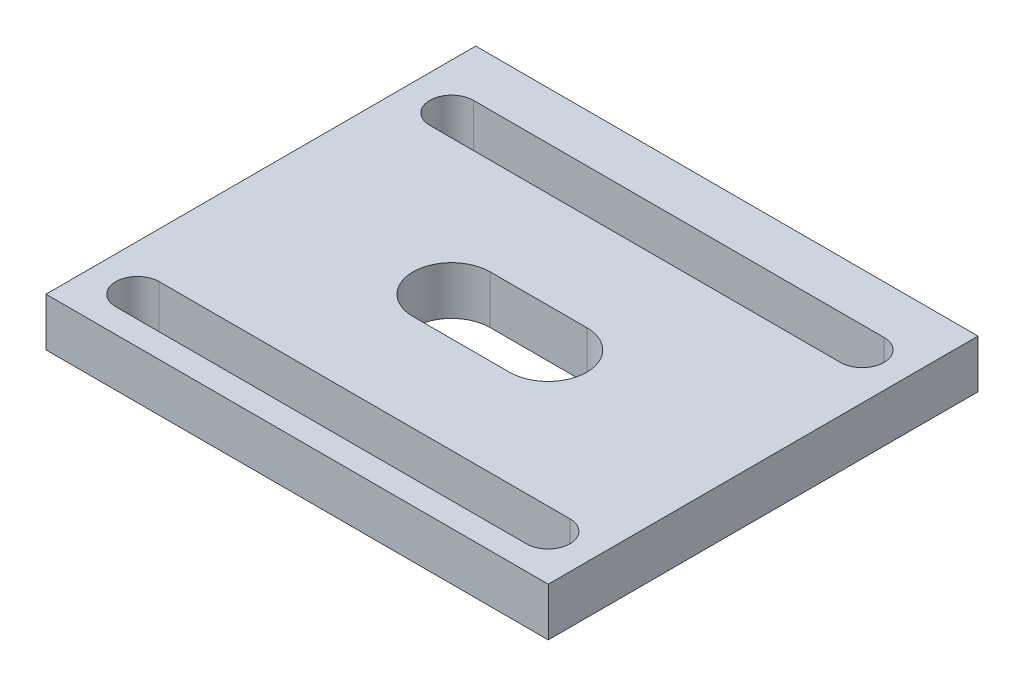
ISO-10303-21;
HEADER;
FILE_DESCRIPTION(('STEP AP214'),'2;1');
FILE_NAME('part.step','',(''),(''),'','','');
FILE_SCHEMA(('AUTOMOTIVE_DESIGN { 1 0 10303 214 1 1 1 1 }'));
ENDSEC;
DATA;
#1=APPLICATION_CONTEXT('core data for automotive mechanical design processes');
#2=APPLICATION_PROTOCOL_DEFINITION('international standard','automotive_design',2000,#1);
#3=PRODUCT_CONTEXT('',#1,'mechanical');
#4=PRODUCT('Part','Part','',(#3));
#5=PRODUCT_RELATED_PRODUCT_CATEGORY('part','',(#4));
#6=PRODUCT_DEFINITION_FORMATION('','',#4);
#7=PRODUCT_DEFINITION_CONTEXT('part definition',#1,'design');
#8=PRODUCT_DEFINITION('design','',#6,#7);
#9=PRODUCT_DEFINITION_SHAPE('','',#8);
#10=(LENGTH_UNIT() NAMED_UNIT(*) SI_UNIT(.MILLI.,.METRE.));
#11=(NAMED_UNIT(*) PLANE_ANGLE_UNIT() SI_UNIT($,.RADIAN.));
#12=(NAMED_UNIT(*) SI_UNIT($,.STERADIAN.) SOLID_ANGLE_UNIT());
#13=UNCERTAINTY_MEASURE_WITH_UNIT(LENGTH_MEASURE(1.E-05),#10,'distance_accuracy_value','');
#14=(GEOMETRIC_REPRESENTATION_CONTEXT(3) GLOBAL_UNCERTAINTY_ASSIGNED_CONTEXT((#13)) GLOBAL_UNIT_ASSIGNED_CONTEXT((#10,
#11,#12)) REPRESENTATION_CONTEXT('',''));
#15=CARTESIAN_POINT('',(0.,0.,0.));
#16=DIRECTION('',(0.,0.,1.));
#17=DIRECTION('',(1.,0.,0.));
#18=AXIS2_PLACEMENT_3D('',#15,#16,#17);
#19=CARTESIAN_POINT('',(90.6267671094663,5.,-29.3531684248269));
#20=DIRECTION('',(0.,1.,0.));
#21=DIRECTION('',(0.,0.,1.));
#22=AXIS2_PLACEMENT_3D('',#19,#20,#21);
#23=PLANE('',#22);
#24=DIRECTION('',(1.,0.,0.));
#25=VECTOR('',#24,1.);
#26=CARTESIAN_POINT('',(48.6267671094663,5.,6.14683157517306));
#27=LINE('',#26,#25);
#28=CARTESIAN_POINT('',(48.6267671094663,5.,6.14683157517306));
#29=VERTEX_POINT('',#28);
#30=CARTESIAN_POINT('',(58.6267671094663,5.,6.14683157517306));
#31=VERTEX_POINT('',#30);
#32=EDGE_CURVE('E179',#29,#31,#27,.T.);
#33=ORIENTED_EDGE('',*,*,#32,.F.);
#34=CARTESIAN_POINT('',(48.6267671094662,5.,2.14683157517306));
#35=DIRECTION('',(0.,1.,0.));
#36=DIRECTION('',(0.,0.,1.));
#37=AXIS2_PLACEMENT_3D('',#34,#35,#36);
#38=CIRCLE('',#37,4.);
#39=CARTESIAN_POINT('',(48.6267671094663,5.,-1.85316842482694));
#40=VERTEX_POINT('',#39);
#41=EDGE_CURVE('E177',#40,#29,#38,.T.);
#42=ORIENTED_EDGE('',*,*,#41,.F.);
#43=DIRECTION('',(-1.,0.,0.));
#44=VECTOR('',#43,1.);
#45=CARTESIAN_POINT('',(48.6267671094663,5.,-1.85316842482694));
#46=LINE('',#45,#44);
#47=CARTESIAN_POINT('',(58.6267671094663,5.,-1.85316842482694));
#48=VERTEX_POINT('',#47);
#49=EDGE_CURVE('E184',#48,#40,#46,.T.);
#50=ORIENTED_EDGE('',*,*,#49,.F.);
#51=CARTESIAN_POINT('',(58.6267671094663,5.,2.14683157517306));
#52=DIRECTION('',(0.,1.,0.));
#53=DIRECTION('',(0.,0.,1.));
#54=AXIS2_PLACEMENT_3D('',#51,#52,#53);
#55=CIRCLE('',#54,4.);
#56=EDGE_CURVE('E182',#31,#48,#55,.T.);
#57=ORIENTED_EDGE('',*,*,#56,.F.);
#58=EDGE_LOOP('',(#33,#42,#50,#57));
#59=FACE_BOUND('',#58,.T.);
#60=DIRECTION('',(1.,0.,0.));
#61=VECTOR('',#60,1.);
#62=CARTESIAN_POINT('',(32.3633111421756,5.,20.6602875424637));
#63=LINE('',#62,#61);
#64=CARTESIAN_POINT('',(32.3633111421756,5.,20.6602875424637));
#65=VERTEX_POINT('',#64);
#66=CARTESIAN_POINT('',(74.8902230767569,5.,20.6602875424637));
#67=VERTEX_POINT('',#66);
#68=EDGE_CURVE('E208',#65,#67,#63,.T.);
#69=ORIENTED_EDGE('',*,*,#68,.F.);
#70=CARTESIAN_POINT('',(32.3633111421756,5.,18.4102875424637));
#71=DIRECTION('',(0.,1.,0.));
#72=DIRECTION('',(0.,0.,-1.));
#73=AXIS2_PLACEMENT_3D('',#70,#71,#72);
#74=CIRCLE('',#73,2.25);
#75=CARTESIAN_POINT('',(32.3633111421756,5.,16.1602875424637));
#76=VERTEX_POINT('',#75);
#77=EDGE_CURVE('E206',#76,#65,#74,.T.);
#78=ORIENTED_EDGE('',*,*,#77,.F.);
#79=DIRECTION('',(-1.,0.,0.));
#80=VECTOR('',#79,1.);
#81=CARTESIAN_POINT('',(32.3633111421756,5.,16.1602875424637));
#82=LINE('',#81,#80);
#83=CARTESIAN_POINT('',(74.8902230767569,5.,16.1602875424637));
#84=VERTEX_POINT('',#83);
#85=EDGE_CURVE('E214',#84,#76,#82,.T.);
#86=ORIENTED_EDGE('',*,*,#85,.F.);
#87=CARTESIAN_POINT('',(74.8902230767569,5.,18.4102875424637));
#88=DIRECTION('',(0.,1.,0.));
#89=DIRECTION('',(0.,0.,-1.));
#90=AXIS2_PLACEMENT_3D('',#87,#88,#89);
#91=CIRCLE('',#90,2.25);
#92=EDGE_CURVE('E211',#67,#84,#91,.T.);
#93=ORIENTED_EDGE('',*,*,#92,.F.);
#94=EDGE_LOOP('',(#69,#78,#86,#93));
#95=FACE_BOUND('',#94,.T.);
#96=DIRECTION('',(1.,0.,0.));
#97=VECTOR('',#96,1.);
#98=CARTESIAN_POINT('',(32.3633111421756,5.,-11.8666243921175));
#99=LINE('',#98,#97);
#100=CARTESIAN_POINT('',(32.3633111421756,5.,-11.8666243921175));
#101=VERTEX_POINT('',#100);
#102=CARTESIAN_POINT('',(74.8902230767569,5.,-11.8666243921175));
#103=VERTEX_POINT('',#102);
#104=EDGE_CURVE('E239',#101,#103,#99,.T.);
#105=ORIENTED_EDGE('',*,*,#104,.F.);
#106=CARTESIAN_POINT('',(32.3633111421756,5.,-14.1166243921175));
#107=DIRECTION('',(0.,1.,0.));
#108=DIRECTION('',(0.,0.,1.));
#109=AXIS2_PLACEMENT_3D('',#106,#107,#108);
#110=CIRCLE('',#109,2.25);
#111=CARTESIAN_POINT('',(32.3633111421756,5.,-16.3666243921175));
#112=VERTEX_POINT('',#111);
#113=EDGE_CURVE('E237',#112,#101,#110,.T.);
#114=ORIENTED_EDGE('',*,*,#113,.F.);
#115=DIRECTION('',(-1.,0.,0.));
#116=VECTOR('',#115,1.);
#117=CARTESIAN_POINT('',(32.3633111421756,5.,-16.3666243921175));
#118=LINE('',#117,#116);
#119=CARTESIAN_POINT('',(74.8902230767569,5.,-16.3666243921175));
#120=VERTEX_POINT('',#119);
#121=EDGE_CURVE('E245',#120,#112,#118,.T.);
#122=ORIENTED_EDGE('',*,*,#121,.F.);
#123=CARTESIAN_POINT('',(74.8902230767569,5.,-14.1166243921175));
#124=DIRECTION('',(0.,1.,0.));
#125=DIRECTION('',(0.,0.,1.));
#126=AXIS2_PLACEMENT_3D('',#123,#124,#125);
#127=CIRCLE('',#126,2.25);
#128=EDGE_CURVE('E242',#103,#120,#127,.T.);
#129=ORIENTED_EDGE('',*,*,#128,.F.);
#130=EDGE_LOOP('',(#105,#114,#122,#129));
#131=FACE_BOUND('',#130,.T.);
#132=DIRECTION('',(0.,0.,-1.));
#133=VECTOR('',#132,1.);
#134=CARTESIAN_POINT('',(27.6267671094663,5.,-31.3531684248269));
#135=LINE('',#134,#133);
#136=CARTESIAN_POINT('',(27.6267671094663,5.,23.1468315751731));
#137=VERTEX_POINT('',#136);
#138=CARTESIAN_POINT('',(27.6267671094663,5.,-21.3531684248269));
#139=VERTEX_POINT('',#138);
#140=EDGE_CURVE('E161',#137,#139,#135,.T.);
#141=ORIENTED_EDGE('',*,*,#140,.F.);
#142=DIRECTION('',(1.,0.,0.));
#143=VECTOR('',#142,1.);
#144=CARTESIAN_POINT('',(0.,5.,23.1468315751731));
#145=LINE('',#144,#143);
#146=CARTESIAN_POINT('',(79.6402230767569,5.,23.1468315751731));
#147=VERTEX_POINT('',#146);
#148=EDGE_CURVE('E148',#137,#147,#145,.T.);
#149=ORIENTED_EDGE('',*,*,#148,.T.);
#150=DIRECTION('',(0.,0.,1.));
#151=VECTOR('',#150,1.);
#152=CARTESIAN_POINT('',(79.6402230767569,5.,0.));
#153=LINE('',#152,#151);
#154=CARTESIAN_POINT('',(79.6402230767569,5.,-21.3531684248269));
#155=VERTEX_POINT('',#154);
#156=EDGE_CURVE('E475',#155,#147,#153,.T.);
#157=ORIENTED_EDGE('',*,*,#156,.F.);
#158=DIRECTION('',(1.,0.,0.));
#159=VECTOR('',#158,1.);
#160=CARTESIAN_POINT('',(0.,5.,-21.3531684248269));
#161=LINE('',#160,#159);
#162=EDGE_CURVE('E167',#139,#155,#161,.T.);
#163=ORIENTED_EDGE('',*,*,#162,.F.);
#164=EDGE_LOOP('',(#141,#149,#157,#163));
#165=FACE_BOUND('',#164,.T.);
#166=ADVANCED_FACE('F38',(#59,#95,#131,#165),#23,.T.);
#167=CARTESIAN_POINT('',(90.6267671094663,0.,-29.3531684248269));
#168=DIRECTION('',(0.,1.,0.));
#169=DIRECTION('',(0.,0.,1.));
#170=AXIS2_PLACEMENT_3D('',#167,#168,#169);
#171=PLANE('',#170);
#172=CARTESIAN_POINT('',(32.3633111421756,0.,18.4102875424637));
#173=DIRECTION('',(0.,1.,0.));
#174=DIRECTION('',(0.,0.,-1.));
#175=AXIS2_PLACEMENT_3D('',#172,#173,#174);
#176=CIRCLE('',#175,2.25);
#177=CARTESIAN_POINT('',(32.3633111421756,0.,16.1602875424637));
#178=VERTEX_POINT('',#177);
#179=CARTESIAN_POINT('',(32.3633111421756,0.,20.6602875424637));
#180=VERTEX_POINT('',#179);
#181=EDGE_CURVE('E205',#178,#180,#176,.T.);
#182=ORIENTED_EDGE('',*,*,#181,.T.);
#183=DIRECTION('',(1.,0.,0.));
#184=VECTOR('',#183,1.);
#185=CARTESIAN_POINT('',(32.3633111421756,0.,20.6602875424637));
#186=LINE('',#185,#184);
#187=CARTESIAN_POINT('',(74.8902230767569,0.,20.6602875424637));
#188=VERTEX_POINT('',#187);
#189=EDGE_CURVE('E219',#180,#188,#186,.T.);
#190=ORIENTED_EDGE('',*,*,#189,.T.);
#191=CARTESIAN_POINT('',(74.8902230767569,0.,18.4102875424637));
#192=DIRECTION('',(0.,1.,0.));
#193=DIRECTION('',(0.,0.,-1.));
#194=AXIS2_PLACEMENT_3D('',#191,#192,#193);
#195=CIRCLE('',#194,2.25);
#196=CARTESIAN_POINT('',(74.8902230767569,0.,16.1602875424637));
#197=VERTEX_POINT('',#196);
#198=EDGE_CURVE('E222',#188,#197,#195,.T.);
#199=ORIENTED_EDGE('',*,*,#198,.T.);
#200=DIRECTION('',(-1.,0.,0.));
#201=VECTOR('',#200,1.);
#202=CARTESIAN_POINT('',(32.3633111421756,0.,16.1602875424637));
#203=LINE('',#202,#201);
#204=EDGE_CURVE('E209',#197,#178,#203,.T.);
#205=ORIENTED_EDGE('',*,*,#204,.T.);
#206=EDGE_LOOP('',(#182,#190,#199,#205));
#207=FACE_BOUND('',#206,.T.);
#208=CARTESIAN_POINT('',(32.3633111421756,0.,-14.1166243921175));
#209=DIRECTION('',(0.,1.,0.));
#210=DIRECTION('',(0.,0.,1.));
#211=AXIS2_PLACEMENT_3D('',#208,#209,#210);
#212=CIRCLE('',#211,2.25);
#213=CARTESIAN_POINT('',(32.3633111421756,0.,-16.3666243921175));
#214=VERTEX_POINT('',#213);
#215=CARTESIAN_POINT('',(32.3633111421756,0.,-11.8666243921175));
#216=VERTEX_POINT('',#215);
#217=EDGE_CURVE('E236',#214,#216,#212,.T.);
#218=ORIENTED_EDGE('',*,*,#217,.T.);
#219=DIRECTION('',(1.,0.,0.));
#220=VECTOR('',#219,1.);
#221=CARTESIAN_POINT('',(32.3633111421756,0.,-11.8666243921175));
#222=LINE('',#221,#220);
#223=CARTESIAN_POINT('',(74.8902230767569,0.,-11.8666243921175));
#224=VERTEX_POINT('',#223);
#225=EDGE_CURVE('E250',#216,#224,#222,.T.);
#226=ORIENTED_EDGE('',*,*,#225,.T.);
#227=CARTESIAN_POINT('',(74.8902230767569,0.,-14.1166243921175));
#228=DIRECTION('',(0.,1.,0.));
#229=DIRECTION('',(0.,0.,1.));
#230=AXIS2_PLACEMENT_3D('',#227,#228,#229);
#231=CIRCLE('',#230,2.25);
#232=CARTESIAN_POINT('',(74.8902230767569,0.,-16.3666243921175));
#233=VERTEX_POINT('',#232);
#234=EDGE_CURVE('E253',#224,#233,#231,.T.);
#235=ORIENTED_EDGE('',*,*,#234,.T.);
#236=DIRECTION('',(-1.,0.,0.));
#237=VECTOR('',#236,1.);
#238=CARTESIAN_POINT('',(32.3633111421756,0.,-16.3666243921175));
#239=LINE('',#238,#237);
#240=EDGE_CURVE('E240',#233,#214,#239,.T.);
#241=ORIENTED_EDGE('',*,*,#240,.T.);
#242=EDGE_LOOP('',(#218,#226,#235,#241));
#243=FACE_BOUND('',#242,.T.);
#244=CARTESIAN_POINT('',(48.6267671094662,0.,2.14683157517306));
#245=DIRECTION('',(0.,1.,0.));
#246=DIRECTION('',(0.,0.,1.));
#247=AXIS2_PLACEMENT_3D('',#244,#245,#246);
#248=CIRCLE('',#247,4.);
#249=CARTESIAN_POINT('',(48.6267671094663,0.,-1.85316842482694));
#250=VERTEX_POINT('',#249);
#251=CARTESIAN_POINT('',(48.6267671094663,0.,6.14683157517306));
#252=VERTEX_POINT('',#251);
#253=EDGE_CURVE('E170',#250,#252,#248,.T.);
#254=ORIENTED_EDGE('',*,*,#253,.T.);
#255=DIRECTION('',(1.,0.,0.));
#256=VECTOR('',#255,1.);
#257=CARTESIAN_POINT('',(48.6267671094663,0.,6.14683157517306));
#258=LINE('',#257,#256);
#259=CARTESIAN_POINT('',(58.6267671094663,0.,6.14683157517306));
#260=VERTEX_POINT('',#259);
#261=EDGE_CURVE('E189',#252,#260,#258,.T.);
#262=ORIENTED_EDGE('',*,*,#261,.T.);
#263=CARTESIAN_POINT('',(58.6267671094663,0.,2.14683157517306));
#264=DIRECTION('',(0.,1.,0.));
#265=DIRECTION('',(0.,0.,1.));
#266=AXIS2_PLACEMENT_3D('',#263,#264,#265);
#267=CIRCLE('',#266,4.);
#268=CARTESIAN_POINT('',(58.6267671094663,0.,-1.85316842482694));
#269=VERTEX_POINT('',#268);
#270=EDGE_CURVE('E192',#260,#269,#267,.T.);
#271=ORIENTED_EDGE('',*,*,#270,.T.);
#272=DIRECTION('',(-1.,0.,0.));
#273=VECTOR('',#272,1.);
#274=CARTESIAN_POINT('',(48.6267671094663,0.,-1.85316842482694));
#275=LINE('',#274,#273);
#276=EDGE_CURVE('E180',#269,#250,#275,.T.);
#277=ORIENTED_EDGE('',*,*,#276,.T.);
#278=EDGE_LOOP('',(#254,#262,#271,#277));
#279=FACE_BOUND('',#278,.T.);
#280=DIRECTION('',(1.,0.,0.));
#281=VECTOR('',#280,1.);
#282=CARTESIAN_POINT('',(90.6267671094663,0.,23.1468315751731));
#283=LINE('',#282,#281);
#284=CARTESIAN_POINT('',(27.6267671094663,0.,23.1468315751731));
#285=VERTEX_POINT('',#284);
#286=CARTESIAN_POINT('',(79.6402230767569,0.,23.1468315751731));
#287=VERTEX_POINT('',#286);
#288=EDGE_CURVE('E52',#285,#287,#283,.T.);
#289=ORIENTED_EDGE('',*,*,#288,.F.);
#290=DIRECTION('',(0.,0.,-1.));
#291=VECTOR('',#290,1.);
#292=CARTESIAN_POINT('',(27.6267671094663,0.,-29.3531684248269));
#293=LINE('',#292,#291);
#294=CARTESIAN_POINT('',(27.6267671094663,0.,-21.3531684248269));
#295=VERTEX_POINT('',#294);
#296=EDGE_CURVE('E163',#285,#295,#293,.T.);
#297=ORIENTED_EDGE('',*,*,#296,.T.);
#298=DIRECTION('',(1.,0.,0.));
#299=VECTOR('',#298,1.);
#300=CARTESIAN_POINT('',(90.6267671094663,0.,-21.3531684248269));
#301=LINE('',#300,#299);
#302=CARTESIAN_POINT('',(79.6402230767569,0.,-21.3531684248269));
#303=VERTEX_POINT('',#302);
#304=EDGE_CURVE('E168',#295,#303,#301,.T.);
#305=ORIENTED_EDGE('',*,*,#304,.T.);
#306=DIRECTION('',(0.,0.,1.));
#307=VECTOR('',#306,1.);
#308=CARTESIAN_POINT('',(79.6402230767569,0.,-29.3531684248269));
#309=LINE('',#308,#307);
#310=EDGE_CURVE('E173',#303,#287,#309,.T.);
#311=ORIENTED_EDGE('',*,*,#310,.T.);
#312=EDGE_LOOP('',(#289,#297,#305,#311));
#313=FACE_BOUND('',#312,.T.);
#314=ADVANCED_FACE('F40',(#207,#243,#279,#313),#171,.F.);
#315=CARTESIAN_POINT('',(27.6267671094663,-5.,-31.3531684248269));
#316=DIRECTION('',(1.,0.,0.));
#317=DIRECTION('',(0.,0.,-1.));
#318=AXIS2_PLACEMENT_3D('',#315,#316,#317);
#319=PLANE('',#318);
#320=DIRECTION('',(0.,1.,0.));
#321=VECTOR('',#320,1.);
#322=CARTESIAN_POINT('',(27.6267671094663,-5.,23.1468315751731));
#323=LINE('',#322,#321);
#324=EDGE_CURVE('E151',#285,#137,#323,.T.);
#325=ORIENTED_EDGE('',*,*,#324,.T.);
#326=ORIENTED_EDGE('',*,*,#140,.T.);
#327=DIRECTION('',(0.,1.,0.));
#328=VECTOR('',#327,1.);
#329=CARTESIAN_POINT('',(27.6267671094663,-5.,-21.3531684248269));
#330=LINE('',#329,#328);
#331=EDGE_CURVE('E479',#295,#139,#330,.T.);
#332=ORIENTED_EDGE('',*,*,#331,.F.);
#333=ORIENTED_EDGE('',*,*,#296,.F.);
#334=EDGE_LOOP('',(#325,#326,#332,#333));
#335=FACE_BOUND('',#334,.T.);
#336=ADVANCED_FACE('F159',(#335),#319,.F.);
#337=CARTESIAN_POINT('',(79.6402230767569,-5.,0.));
#338=DIRECTION('',(-1.,0.,0.));
#339=DIRECTION('',(0.,0.,1.));
#340=AXIS2_PLACEMENT_3D('',#337,#338,#339);
#341=PLANE('',#340);
#342=DIRECTION('',(0.,1.,0.));
#343=VECTOR('',#342,1.);
#344=CARTESIAN_POINT('',(79.6402230767569,-5.,23.1468315751731));
#345=LINE('',#344,#343);
#346=EDGE_CURVE('E11',#287,#147,#345,.T.);
#347=ORIENTED_EDGE('',*,*,#346,.F.);
#348=ORIENTED_EDGE('',*,*,#310,.F.);
#349=DIRECTION('',(0.,1.,0.));
#350=VECTOR('',#349,1.);
#351=CARTESIAN_POINT('',(79.6402230767569,-5.,-21.3531684248269));
#352=LINE('',#351,#350);
#353=EDGE_CURVE('E480',#303,#155,#352,.T.);
#354=ORIENTED_EDGE('',*,*,#353,.T.);
#355=ORIENTED_EDGE('',*,*,#156,.T.);
#356=EDGE_LOOP('',(#347,#348,#354,#355));
#357=FACE_BOUND('',#356,.T.);
#358=ADVANCED_FACE('F303',(#357),#341,.F.);
#359=CARTESIAN_POINT('',(32.3633111421756,5.,-14.1166243921175));
#360=DIRECTION('',(0.,-1.,0.));
#361=DIRECTION('',(0.,0.,-1.));
#362=AXIS2_PLACEMENT_3D('',#359,#360,#361);
#363=CYLINDRICAL_SURFACE('',#362,2.25);
#364=ORIENTED_EDGE('',*,*,#217,.F.);
#365=DIRECTION('',(0.,-1.,0.));
#366=VECTOR('',#365,1.);
#367=CARTESIAN_POINT('',(32.3633111421756,5.,-16.3666243921175));
#368=LINE('',#367,#366);
#369=EDGE_CURVE('E247',#112,#214,#368,.T.);
#370=ORIENTED_EDGE('',*,*,#369,.F.);
#371=ORIENTED_EDGE('',*,*,#113,.T.);
#372=DIRECTION('',(0.,-1.,0.));
#373=VECTOR('',#372,1.);
#374=CARTESIAN_POINT('',(32.3633111421756,5.,-11.8666243921175));
#375=LINE('',#374,#373);
#376=EDGE_CURVE('E46',#101,#216,#375,.T.);
#377=ORIENTED_EDGE('',*,*,#376,.T.);
#378=EDGE_LOOP('',(#364,#370,#371,#377));
#379=FACE_BOUND('',#378,.T.);
#380=ADVANCED_FACE('F266',(#379),#363,.F.);
#381=CARTESIAN_POINT('',(32.3633111421756,5.,-11.8666243921175));
#382=DIRECTION('',(0.,0.,-1.));
#383=DIRECTION('',(-1.,0.,0.));
#384=AXIS2_PLACEMENT_3D('',#381,#382,#383);
#385=PLANE('',#384);
#386=ORIENTED_EDGE('',*,*,#225,.F.);
#387=ORIENTED_EDGE('',*,*,#376,.F.);
#388=ORIENTED_EDGE('',*,*,#104,.T.);
#389=DIRECTION('',(0.,-1.,0.));
#390=VECTOR('',#389,1.);
#391=CARTESIAN_POINT('',(74.8902230767569,5.,-11.8666243921175));
#392=LINE('',#391,#390);
#393=EDGE_CURVE('E262',#103,#224,#392,.T.);
#394=ORIENTED_EDGE('',*,*,#393,.T.);
#395=EDGE_LOOP('',(#386,#387,#388,#394));
#396=FACE_BOUND('',#395,.T.);
#397=ADVANCED_FACE('F281',(#396),#385,.T.);
#398=CARTESIAN_POINT('',(74.8902230767569,5.,-14.1166243921175));
#399=DIRECTION('',(0.,-1.,0.));
#400=DIRECTION('',(0.,0.,-1.));
#401=AXIS2_PLACEMENT_3D('',#398,#399,#400);
#402=CYLINDRICAL_SURFACE('',#401,2.25);
#403=ORIENTED_EDGE('',*,*,#234,.F.);
#404=ORIENTED_EDGE('',*,*,#393,.F.);
#405=ORIENTED_EDGE('',*,*,#128,.T.);
#406=DIRECTION('',(0.,-1.,0.));
#407=VECTOR('',#406,1.);
#408=CARTESIAN_POINT('',(74.8902230767569,5.,-16.3666243921175));
#409=LINE('',#408,#407);
#410=EDGE_CURVE('E260',#120,#233,#409,.T.);
#411=ORIENTED_EDGE('',*,*,#410,.T.);
#412=EDGE_LOOP('',(#403,#404,#405,#411));
#413=FACE_BOUND('',#412,.T.);
#414=ADVANCED_FACE('F283',(#413),#402,.F.);
#415=CARTESIAN_POINT('',(32.3633111421756,5.,-16.3666243921175));
#416=DIRECTION('',(0.,0.,1.));
#417=DIRECTION('',(1.,0.,0.));
#418=AXIS2_PLACEMENT_3D('',#415,#416,#417);
#419=PLANE('',#418);
#420=ORIENTED_EDGE('',*,*,#240,.F.);
#421=ORIENTED_EDGE('',*,*,#410,.F.);
#422=ORIENTED_EDGE('',*,*,#121,.T.);
#423=ORIENTED_EDGE('',*,*,#369,.T.);
#424=EDGE_LOOP('',(#420,#421,#422,#423));
#425=FACE_BOUND('',#424,.T.);
#426=ADVANCED_FACE('F276',(#425),#419,.T.);
#427=CARTESIAN_POINT('',(32.3633111421756,5.,18.4102875424637));
#428=DIRECTION('',(0.,-1.,0.));
#429=DIRECTION('',(0.,0.,-1.));
#430=AXIS2_PLACEMENT_3D('',#427,#428,#429);
#431=CYLINDRICAL_SURFACE('',#430,2.25);
#432=ORIENTED_EDGE('',*,*,#181,.F.);
#433=DIRECTION('',(0.,-1.,0.));
#434=VECTOR('',#433,1.);
#435=CARTESIAN_POINT('',(32.3633111421756,5.,16.1602875424637));
#436=LINE('',#435,#434);
#437=EDGE_CURVE('E216',#76,#178,#436,.T.);
#438=ORIENTED_EDGE('',*,*,#437,.F.);
#439=ORIENTED_EDGE('',*,*,#77,.T.);
#440=DIRECTION('',(0.,-1.,0.));
#441=VECTOR('',#440,1.);
#442=CARTESIAN_POINT('',(32.3633111421756,5.,20.6602875424637));
#443=LINE('',#442,#441);
#444=EDGE_CURVE('E233',#65,#180,#443,.T.);
#445=ORIENTED_EDGE('',*,*,#444,.T.);
#446=EDGE_LOOP('',(#432,#438,#439,#445));
#447=FACE_BOUND('',#446,.T.);
#448=ADVANCED_FACE('F290',(#447),#431,.F.);
#449=CARTESIAN_POINT('',(32.3633111421756,5.,20.6602875424637));
#450=DIRECTION('',(0.,0.,-1.));
#451=DIRECTION('',(-1.,0.,0.));
#452=AXIS2_PLACEMENT_3D('',#449,#450,#451);
#453=PLANE('',#452);
#454=ORIENTED_EDGE('',*,*,#189,.F.);
#455=ORIENTED_EDGE('',*,*,#444,.F.);
#456=ORIENTED_EDGE('',*,*,#68,.T.);
#457=DIRECTION('',(0.,-1.,0.));
#458=VECTOR('',#457,1.);
#459=CARTESIAN_POINT('',(74.8902230767569,5.,20.6602875424637));
#460=LINE('',#459,#458);
#461=EDGE_CURVE('E231',#67,#188,#460,.T.);
#462=ORIENTED_EDGE('',*,*,#461,.T.);
#463=EDGE_LOOP('',(#454,#455,#456,#462));
#464=FACE_BOUND('',#463,.T.);
#465=ADVANCED_FACE('F341',(#464),#453,.T.);
#466=CARTESIAN_POINT('',(74.8902230767569,5.,18.4102875424637));
#467=DIRECTION('',(0.,-1.,0.));
#468=DIRECTION('',(0.,0.,-1.));
#469=AXIS2_PLACEMENT_3D('',#466,#467,#468);
#470=CYLINDRICAL_SURFACE('',#469,2.25);
#471=ORIENTED_EDGE('',*,*,#198,.F.);
#472=ORIENTED_EDGE('',*,*,#461,.F.);
#473=ORIENTED_EDGE('',*,*,#92,.T.);
#474=DIRECTION('',(0.,-1.,0.));
#475=VECTOR('',#474,1.);
#476=CARTESIAN_POINT('',(74.8902230767569,5.,16.1602875424637));
#477=LINE('',#476,#475);
#478=EDGE_CURVE('E229',#84,#197,#477,.T.);
#479=ORIENTED_EDGE('',*,*,#478,.T.);
#480=EDGE_LOOP('',(#471,#472,#473,#479));
#481=FACE_BOUND('',#480,.T.);
#482=ADVANCED_FACE('F337',(#481),#470,.F.);
#483=CARTESIAN_POINT('',(32.3633111421756,5.,16.1602875424637));
#484=DIRECTION('',(0.,0.,1.));
#485=DIRECTION('',(1.,0.,0.));
#486=AXIS2_PLACEMENT_3D('',#483,#484,#485);
#487=PLANE('',#486);
#488=ORIENTED_EDGE('',*,*,#204,.F.);
#489=ORIENTED_EDGE('',*,*,#478,.F.);
#490=ORIENTED_EDGE('',*,*,#85,.T.);
#491=ORIENTED_EDGE('',*,*,#437,.T.);
#492=EDGE_LOOP('',(#488,#489,#490,#491));
#493=FACE_BOUND('',#492,.T.);
#494=ADVANCED_FACE('F333',(#493),#487,.T.);
#495=CARTESIAN_POINT('',(48.6267671094662,5.,2.14683157517306));
#496=DIRECTION('',(0.,-1.,0.));
#497=DIRECTION('',(0.,0.,-1.));
#498=AXIS2_PLACEMENT_3D('',#495,#496,#497);
#499=CYLINDRICAL_SURFACE('',#498,4.);
#500=ORIENTED_EDGE('',*,*,#253,.F.);
#501=DIRECTION('',(0.,-1.,0.));
#502=VECTOR('',#501,1.);
#503=CARTESIAN_POINT('',(48.6267671094663,5.,-1.85316842482694));
#504=LINE('',#503,#502);
#505=EDGE_CURVE('E186',#40,#250,#504,.T.);
#506=ORIENTED_EDGE('',*,*,#505,.F.);
#507=ORIENTED_EDGE('',*,*,#41,.T.);
#508=DIRECTION('',(0.,-1.,0.));
#509=VECTOR('',#508,1.);
#510=CARTESIAN_POINT('',(48.6267671094663,5.,6.14683157517306));
#511=LINE('',#510,#509);
#512=EDGE_CURVE('E202',#29,#252,#511,.T.);
#513=ORIENTED_EDGE('',*,*,#512,.T.);
#514=EDGE_LOOP('',(#500,#506,#507,#513));
#515=FACE_BOUND('',#514,.T.);
#516=ADVANCED_FACE('F329',(#515),#499,.F.);
#517=CARTESIAN_POINT('',(48.6267671094663,5.,6.14683157517306));
#518=DIRECTION('',(0.,0.,-1.));
#519=DIRECTION('',(-1.,0.,0.));
#520=AXIS2_PLACEMENT_3D('',#517,#518,#519);
#521=PLANE('',#520);
#522=ORIENTED_EDGE('',*,*,#261,.F.);
#523=ORIENTED_EDGE('',*,*,#512,.F.);
#524=ORIENTED_EDGE('',*,*,#32,.T.);
#525=DIRECTION('',(0.,-1.,0.));
#526=VECTOR('',#525,1.);
#527=CARTESIAN_POINT('',(58.6267671094663,5.,6.14683157517306));
#528=LINE('',#527,#526);
#529=EDGE_CURVE('E200',#31,#260,#528,.T.);
#530=ORIENTED_EDGE('',*,*,#529,.T.);
#531=EDGE_LOOP('',(#522,#523,#524,#530));
#532=FACE_BOUND('',#531,.T.);
#533=ADVANCED_FACE('F325',(#532),#521,.T.);
#534=CARTESIAN_POINT('',(58.6267671094663,5.,2.14683157517306));
#535=DIRECTION('',(0.,-1.,0.));
#536=DIRECTION('',(0.,0.,-1.));
#537=AXIS2_PLACEMENT_3D('',#534,#535,#536);
#538=CYLINDRICAL_SURFACE('',#537,4.);
#539=ORIENTED_EDGE('',*,*,#270,.F.);
#540=ORIENTED_EDGE('',*,*,#529,.F.);
#541=ORIENTED_EDGE('',*,*,#56,.T.);
#542=DIRECTION('',(0.,-1.,0.));
#543=VECTOR('',#542,1.);
#544=CARTESIAN_POINT('',(58.6267671094663,5.,-1.85316842482694));
#545=LINE('',#544,#543);
#546=EDGE_CURVE('E60',#48,#269,#545,.T.);
#547=ORIENTED_EDGE('',*,*,#546,.T.);
#548=EDGE_LOOP('',(#539,#540,#541,#547));
#549=FACE_BOUND('',#548,.T.);
#550=ADVANCED_FACE('F322',(#549),#538,.F.);
#551=CARTESIAN_POINT('',(48.6267671094663,5.,-1.85316842482694));
#552=DIRECTION('',(0.,0.,1.));
#553=DIRECTION('',(1.,0.,0.));
#554=AXIS2_PLACEMENT_3D('',#551,#552,#553);
#555=PLANE('',#554);
#556=ORIENTED_EDGE('',*,*,#276,.F.);
#557=ORIENTED_EDGE('',*,*,#546,.F.);
#558=ORIENTED_EDGE('',*,*,#49,.T.);
#559=ORIENTED_EDGE('',*,*,#505,.T.);
#560=EDGE_LOOP('',(#556,#557,#558,#559));
#561=FACE_BOUND('',#560,.T.);
#562=ADVANCED_FACE('F317',(#561),#555,.T.);
#563=CARTESIAN_POINT('',(0.,-5.,-21.3531684248269));
#564=DIRECTION('',(0.,0.,1.));
#565=DIRECTION('',(1.,0.,0.));
#566=AXIS2_PLACEMENT_3D('',#563,#564,#565);
#567=PLANE('',#566);
#568=ORIENTED_EDGE('',*,*,#331,.T.);
#569=ORIENTED_EDGE('',*,*,#162,.T.);
#570=ORIENTED_EDGE('',*,*,#353,.F.);
#571=ORIENTED_EDGE('',*,*,#304,.F.);
#572=EDGE_LOOP('',(#568,#569,#570,#571));
#573=FACE_BOUND('',#572,.T.);
#574=ADVANCED_FACE('F315',(#573),#567,.F.);
#575=CARTESIAN_POINT('',(0.,-5.,23.1468315751731));
#576=DIRECTION('',(0.,0.,1.));
#577=DIRECTION('',(1.,0.,0.));
#578=AXIS2_PLACEMENT_3D('',#575,#576,#577);
#579=PLANE('',#578);
#580=ORIENTED_EDGE('',*,*,#288,.T.);
#581=ORIENTED_EDGE('',*,*,#346,.T.);
#582=ORIENTED_EDGE('',*,*,#148,.F.);
#583=ORIENTED_EDGE('',*,*,#324,.F.);
#584=EDGE_LOOP('',(#580,#581,#582,#583));
#585=FACE_BOUND('',#584,.T.);
#586=ADVANCED_FACE('F150',(#585),#579,.T.);
#587=CLOSED_SHELL('',(#166,#314,#336,#358,#380,#397,#414,#426,#448,#465,#482,#494,#516,#533,
#550,#562,#574,#586));
#588=MANIFOLD_SOLID_BREP('B2',#587);
#589=ADVANCED_BREP_SHAPE_REPRESENTATION('',(#18,#588),#14);
#590=SHAPE_DEFINITION_REPRESENTATION(#9,#589);
ENDSEC;
END-ISO-10303-21;
